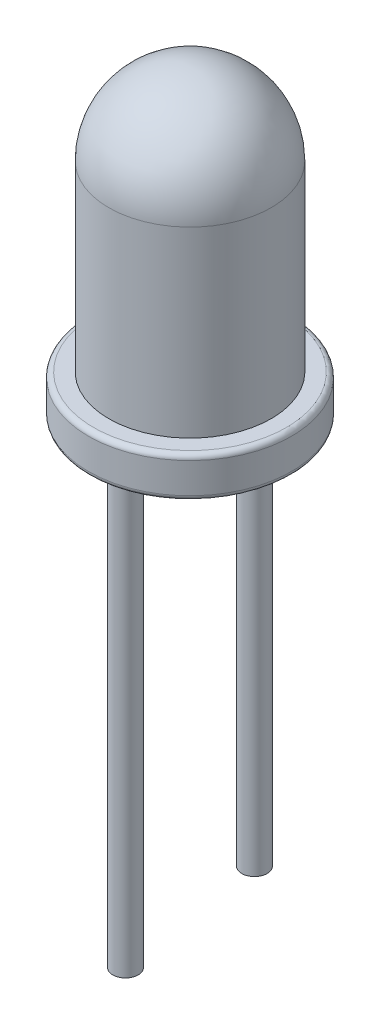
ISO-10303-21;
HEADER;
FILE_DESCRIPTION(('STEP AP214'),'2;1');
FILE_NAME('part.step','',(''),(''),'','','');
FILE_SCHEMA(('AUTOMOTIVE_DESIGN { 1 0 10303 214 1 1 1 1 }'));
ENDSEC;
DATA;
#1=APPLICATION_CONTEXT('core data for automotive mechanical design processes');
#2=APPLICATION_PROTOCOL_DEFINITION('international standard','automotive_design',2000,#1);
#3=PRODUCT_CONTEXT('',#1,'mechanical');
#4=PRODUCT('Part','Part','',(#3));
#5=PRODUCT_RELATED_PRODUCT_CATEGORY('part','',(#4));
#6=PRODUCT_DEFINITION_FORMATION('','',#4);
#7=PRODUCT_DEFINITION_CONTEXT('part definition',#1,'design');
#8=PRODUCT_DEFINITION('design','',#6,#7);
#9=PRODUCT_DEFINITION_SHAPE('','',#8);
#10=(LENGTH_UNIT() NAMED_UNIT(*) SI_UNIT(.MILLI.,.METRE.));
#11=(NAMED_UNIT(*) PLANE_ANGLE_UNIT() SI_UNIT($,.RADIAN.));
#12=(NAMED_UNIT(*) SI_UNIT($,.STERADIAN.) SOLID_ANGLE_UNIT());
#13=UNCERTAINTY_MEASURE_WITH_UNIT(LENGTH_MEASURE(1.E-05),#10,'distance_accuracy_value','');
#14=(GEOMETRIC_REPRESENTATION_CONTEXT(3) GLOBAL_UNCERTAINTY_ASSIGNED_CONTEXT((#13)) GLOBAL_UNIT_ASSIGNED_CONTEXT((#10,
#11,#12)) REPRESENTATION_CONTEXT('',''));
#15=CARTESIAN_POINT('',(0.,0.,0.));
#16=DIRECTION('',(0.,0.,1.));
#17=DIRECTION('',(1.,0.,0.));
#18=AXIS2_PLACEMENT_3D('',#15,#16,#17);
#19=CARTESIAN_POINT('',(0.,4.4,0.));
#20=DIRECTION('',(0.,1.,0.));
#21=DIRECTION('',(-1.,0.,0.));
#22=AXIS2_PLACEMENT_3D('',#19,#20,#21);
#23=SPHERICAL_SURFACE('',#22,1.6);
#24=CARTESIAN_POINT('',(0.,4.4,0.));
#25=DIRECTION('',(0.,1.,0.));
#26=DIRECTION('',(0.,0.,1.));
#27=AXIS2_PLACEMENT_3D('',#24,#25,#26);
#28=CIRCLE('',#27,1.6);
#29=CARTESIAN_POINT('',(0.,4.4,1.6));
#30=VERTEX_POINT('',#29);
#31=EDGE_CURVE('E58',#30,#30,#28,.T.);
#32=ORIENTED_EDGE('',*,*,#31,.T.);
#33=EDGE_LOOP('',(#32));
#34=FACE_BOUND('',#33,.T.);
#35=ADVANCED_FACE('F32',(#34),#23,.T.);
#36=CARTESIAN_POINT('',(0.,8.59832072129685,0.));
#37=DIRECTION('',(0.,1.,0.));
#38=DIRECTION('',(0.,0.,1.));
#39=AXIS2_PLACEMENT_3D('',#36,#37,#38);
#40=CYLINDRICAL_SURFACE('',#39,1.6);
#41=ORIENTED_EDGE('',*,*,#31,.F.);
#42=EDGE_LOOP('',(#41));
#43=FACE_BOUND('',#42,.T.);
#44=CARTESIAN_POINT('',(0.,0.799999999999999,0.));
#45=DIRECTION('',(0.,1.,0.));
#46=DIRECTION('',(0.,0.,1.));
#47=AXIS2_PLACEMENT_3D('',#44,#45,#46);
#48=CIRCLE('',#47,1.6);
#49=CARTESIAN_POINT('',(0.,0.799999999999999,1.6));
#50=VERTEX_POINT('',#49);
#51=EDGE_CURVE('E61',#50,#50,#48,.T.);
#52=ORIENTED_EDGE('',*,*,#51,.T.);
#53=EDGE_LOOP('',(#52));
#54=FACE_BOUND('',#53,.T.);
#55=ADVANCED_FACE('F86',(#43,#54),#40,.T.);
#56=CARTESIAN_POINT('',(0.,0.8,0.));
#57=DIRECTION('',(0.,-1.,0.));
#58=DIRECTION('',(0.,0.,-1.));
#59=AXIS2_PLACEMENT_3D('',#56,#57,#58);
#60=PLANE('',#59);
#61=CARTESIAN_POINT('',(0.,0.8,0.));
#62=DIRECTION('',(0.,-1.,0.));
#63=DIRECTION('',(0.,0.,-1.));
#64=AXIS2_PLACEMENT_3D('',#61,#62,#63);
#65=CIRCLE('',#64,1.9);
#66=CARTESIAN_POINT('',(0.,0.8,-1.9));
#67=VERTEX_POINT('',#66);
#68=EDGE_CURVE('E43',#67,#67,#65,.F.);
#69=ORIENTED_EDGE('',*,*,#68,.T.);
#70=EDGE_LOOP('',(#69));
#71=FACE_BOUND('',#70,.T.);
#72=ORIENTED_EDGE('',*,*,#51,.F.);
#73=EDGE_LOOP('',(#72));
#74=FACE_BOUND('',#73,.T.);
#75=ADVANCED_FACE('F92',(#71,#74),#60,.F.);
#76=CARTESIAN_POINT('',(0.,8.59832072129685,0.));
#77=DIRECTION('',(0.,1.,0.));
#78=DIRECTION('',(0.,0.,1.));
#79=AXIS2_PLACEMENT_3D('',#76,#77,#78);
#80=CYLINDRICAL_SURFACE('',#79,2.);
#81=CARTESIAN_POINT('',(0.,0.0999999999999994,0.));
#82=DIRECTION('',(0.,1.,0.));
#83=DIRECTION('',(0.,0.,1.));
#84=AXIS2_PLACEMENT_3D('',#81,#82,#83);
#85=CIRCLE('',#84,2.);
#86=CARTESIAN_POINT('',(0.,0.0999999999999994,2.));
#87=VERTEX_POINT('',#86);
#88=EDGE_CURVE('E52',#87,#87,#85,.T.);
#89=ORIENTED_EDGE('',*,*,#88,.T.);
#90=EDGE_LOOP('',(#89));
#91=FACE_BOUND('',#90,.T.);
#92=CARTESIAN_POINT('',(0.,0.699999999999999,0.));
#93=DIRECTION('',(0.,-1.,0.));
#94=DIRECTION('',(0.,0.,-1.));
#95=AXIS2_PLACEMENT_3D('',#92,#93,#94);
#96=CIRCLE('',#95,2.);
#97=CARTESIAN_POINT('',(0.,0.699999999999999,-2.));
#98=VERTEX_POINT('',#97);
#99=EDGE_CURVE('E55',#98,#98,#96,.T.);
#100=ORIENTED_EDGE('',*,*,#99,.T.);
#101=EDGE_LOOP('',(#100));
#102=FACE_BOUND('',#101,.T.);
#103=ADVANCED_FACE('F105',(#91,#102),#80,.T.);
#104=CARTESIAN_POINT('',(0.,0.,0.));
#105=DIRECTION('',(0.,1.,0.));
#106=DIRECTION('',(0.,0.,1.));
#107=AXIS2_PLACEMENT_3D('',#104,#105,#106);
#108=PLANE('',#107);
#109=CARTESIAN_POINT('',(1.27,0.,0.));
#110=DIRECTION('',(0.,1.,0.));
#111=DIRECTION('',(0.,0.,1.));
#112=AXIS2_PLACEMENT_3D('',#109,#110,#111);
#113=CIRCLE('',#112,0.25);
#114=CARTESIAN_POINT('',(1.27,0.,0.25));
#115=VERTEX_POINT('',#114);
#116=EDGE_CURVE('E10',#115,#115,#113,.F.);
#117=ORIENTED_EDGE('',*,*,#116,.F.);
#118=EDGE_LOOP('',(#117));
#119=FACE_BOUND('',#118,.T.);
#120=CARTESIAN_POINT('',(-1.27,0.,0.));
#121=DIRECTION('',(0.,1.,0.));
#122=DIRECTION('',(0.,0.,1.));
#123=AXIS2_PLACEMENT_3D('',#120,#121,#122);
#124=CIRCLE('',#123,0.25);
#125=CARTESIAN_POINT('',(-1.27,0.,0.25));
#126=VERTEX_POINT('',#125);
#127=EDGE_CURVE('E39',#126,#126,#124,.F.);
#128=ORIENTED_EDGE('',*,*,#127,.F.);
#129=EDGE_LOOP('',(#128));
#130=FACE_BOUND('',#129,.T.);
#131=CARTESIAN_POINT('',(0.,0.,0.));
#132=DIRECTION('',(0.,1.,0.));
#133=DIRECTION('',(0.,0.,1.));
#134=AXIS2_PLACEMENT_3D('',#131,#132,#133);
#135=CIRCLE('',#134,1.9);
#136=CARTESIAN_POINT('',(0.,0.,1.9));
#137=VERTEX_POINT('',#136);
#138=EDGE_CURVE('E47',#137,#137,#135,.F.);
#139=ORIENTED_EDGE('',*,*,#138,.T.);
#140=EDGE_LOOP('',(#139));
#141=FACE_BOUND('',#140,.T.);
#142=ADVANCED_FACE('F98',(#119,#130,#141),#108,.F.);
#143=CARTESIAN_POINT('',(0.,0.0999999999999994,0.));
#144=DIRECTION('',(0.,1.,0.));
#145=DIRECTION('',(0.,0.,1.));
#146=AXIS2_PLACEMENT_3D('',#143,#144,#145);
#147=TOROIDAL_SURFACE('',#146,1.9,0.1);
#148=ORIENTED_EDGE('',*,*,#138,.F.);
#149=EDGE_LOOP('',(#148));
#150=FACE_BOUND('',#149,.T.);
#151=ORIENTED_EDGE('',*,*,#88,.F.);
#152=EDGE_LOOP('',(#151));
#153=FACE_BOUND('',#152,.T.);
#154=ADVANCED_FACE('F96',(#150,#153),#147,.T.);
#155=CARTESIAN_POINT('',(0.,0.699999999999999,0.));
#156=DIRECTION('',(0.,-1.,0.));
#157=DIRECTION('',(0.,0.,-1.));
#158=AXIS2_PLACEMENT_3D('',#155,#156,#157);
#159=TOROIDAL_SURFACE('',#158,1.9,0.1);
#160=ORIENTED_EDGE('',*,*,#99,.F.);
#161=EDGE_LOOP('',(#160));
#162=FACE_BOUND('',#161,.T.);
#163=ORIENTED_EDGE('',*,*,#68,.F.);
#164=EDGE_LOOP('',(#163));
#165=FACE_BOUND('',#164,.T.);
#166=ADVANCED_FACE('F34',(#162,#165),#159,.T.);
#167=CARTESIAN_POINT('',(-1.27,-10.,0.));
#168=DIRECTION('',(0.,1.,0.));
#169=DIRECTION('',(0.,0.,1.));
#170=AXIS2_PLACEMENT_3D('',#167,#168,#169);
#171=CYLINDRICAL_SURFACE('',#170,0.25);
#172=CARTESIAN_POINT('',(-1.27,-10.,0.));
#173=DIRECTION('',(0.,-1.,0.));
#174=DIRECTION('',(0.,0.,-1.));
#175=AXIS2_PLACEMENT_3D('',#172,#173,#174);
#176=CIRCLE('',#175,0.25);
#177=CARTESIAN_POINT('',(-1.27,-10.,-0.25));
#178=VERTEX_POINT('',#177);
#179=EDGE_CURVE('E64',#178,#178,#176,.T.);
#180=ORIENTED_EDGE('',*,*,#179,.F.);
#181=EDGE_LOOP('',(#180));
#182=FACE_BOUND('',#181,.T.);
#183=ORIENTED_EDGE('',*,*,#127,.T.);
#184=EDGE_LOOP('',(#183));
#185=FACE_BOUND('',#184,.T.);
#186=ADVANCED_FACE('F82',(#182,#185),#171,.T.);
#187=CARTESIAN_POINT('',(-1.27,-10.,0.));
#188=DIRECTION('',(0.,-1.,0.));
#189=DIRECTION('',(0.,0.,-1.));
#190=AXIS2_PLACEMENT_3D('',#187,#188,#189);
#191=PLANE('',#190);
#192=ORIENTED_EDGE('',*,*,#179,.T.);
#193=EDGE_LOOP('',(#192));
#194=FACE_BOUND('',#193,.T.);
#195=ADVANCED_FACE('F75',(#194),#191,.T.);
#196=CARTESIAN_POINT('',(1.27,-7.,0.));
#197=DIRECTION('',(0.,1.,0.));
#198=DIRECTION('',(0.,0.,1.));
#199=AXIS2_PLACEMENT_3D('',#196,#197,#198);
#200=CYLINDRICAL_SURFACE('',#199,0.25);
#201=CARTESIAN_POINT('',(1.27,-7.,0.));
#202=DIRECTION('',(0.,-1.,0.));
#203=DIRECTION('',(0.,0.,-1.));
#204=AXIS2_PLACEMENT_3D('',#201,#202,#203);
#205=CIRCLE('',#204,0.25);
#206=CARTESIAN_POINT('',(1.27,-7.,-0.25));
#207=VERTEX_POINT('',#206);
#208=EDGE_CURVE('E67',#207,#207,#205,.T.);
#209=ORIENTED_EDGE('',*,*,#208,.F.);
#210=EDGE_LOOP('',(#209));
#211=FACE_BOUND('',#210,.T.);
#212=ORIENTED_EDGE('',*,*,#116,.T.);
#213=EDGE_LOOP('',(#212));
#214=FACE_BOUND('',#213,.T.);
#215=ADVANCED_FACE('F73',(#211,#214),#200,.T.);
#216=CARTESIAN_POINT('',(1.27,-7.,0.));
#217=DIRECTION('',(0.,-1.,0.));
#218=DIRECTION('',(0.,0.,-1.));
#219=AXIS2_PLACEMENT_3D('',#216,#217,#218);
#220=PLANE('',#219);
#221=ORIENTED_EDGE('',*,*,#208,.T.);
#222=EDGE_LOOP('',(#221));
#223=FACE_BOUND('',#222,.T.);
#224=ADVANCED_FACE('F71',(#223),#220,.T.);
#225=CLOSED_SHELL('',(#35,#55,#75,#103,#142,#154,#166,#186,#195,#215,#224));
#226=MANIFOLD_SOLID_BREP('B2',#225);
#227=ADVANCED_BREP_SHAPE_REPRESENTATION('',(#18,#226),#14);
#228=SHAPE_DEFINITION_REPRESENTATION(#9,#227);
ENDSEC;
END-ISO-10303-21;
